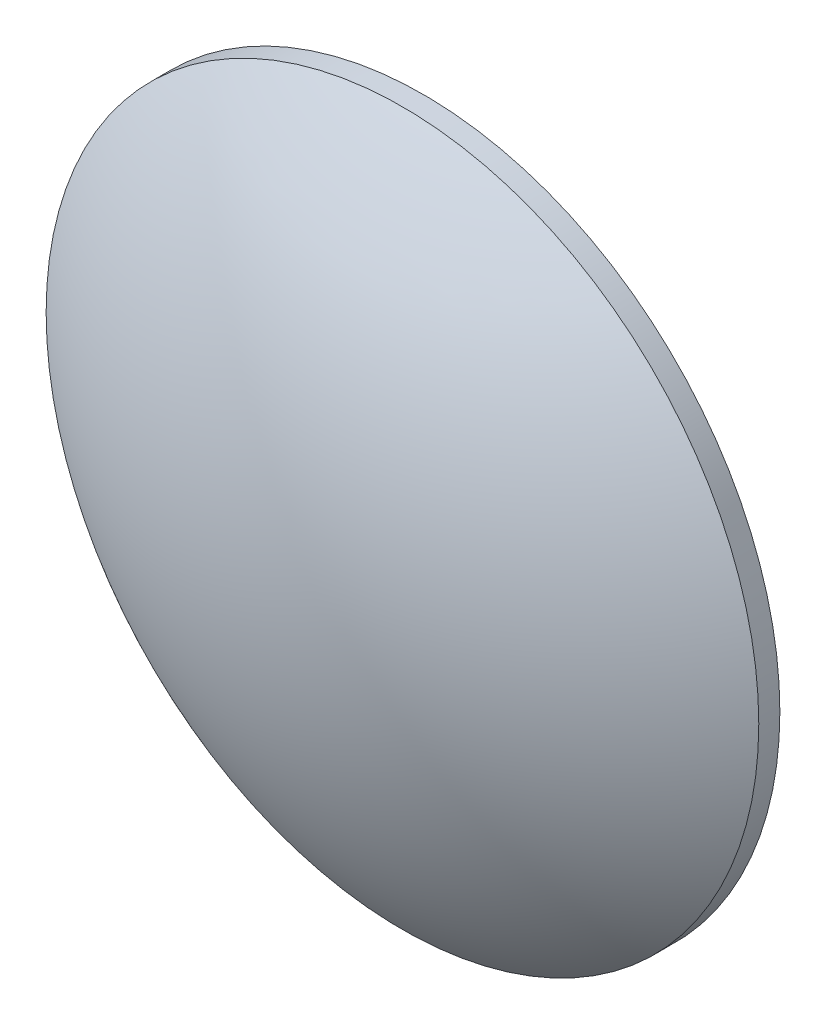
ISO-10303-21;
HEADER;
FILE_DESCRIPTION(('STEP AP214'),'2;1');
FILE_NAME('part.step','',(''),(''),'','','');
FILE_SCHEMA(('AUTOMOTIVE_DESIGN { 1 0 10303 214 1 1 1 1 }'));
ENDSEC;
DATA;
#1=APPLICATION_CONTEXT('core data for automotive mechanical design processes');
#2=APPLICATION_PROTOCOL_DEFINITION('international standard','automotive_design',2000,#1);
#3=PRODUCT_CONTEXT('',#1,'mechanical');
#4=PRODUCT('Part','Part','',(#3));
#5=PRODUCT_RELATED_PRODUCT_CATEGORY('part','',(#4));
#6=PRODUCT_DEFINITION_FORMATION('','',#4);
#7=PRODUCT_DEFINITION_CONTEXT('part definition',#1,'design');
#8=PRODUCT_DEFINITION('design','',#6,#7);
#9=PRODUCT_DEFINITION_SHAPE('','',#8);
#10=(LENGTH_UNIT() NAMED_UNIT(*) SI_UNIT(.MILLI.,.METRE.));
#11=(NAMED_UNIT(*) PLANE_ANGLE_UNIT() SI_UNIT($,.RADIAN.));
#12=(NAMED_UNIT(*) SI_UNIT($,.STERADIAN.) SOLID_ANGLE_UNIT());
#13=UNCERTAINTY_MEASURE_WITH_UNIT(LENGTH_MEASURE(1.E-05),#10,'distance_accuracy_value','');
#14=(GEOMETRIC_REPRESENTATION_CONTEXT(3) GLOBAL_UNCERTAINTY_ASSIGNED_CONTEXT((#13)) GLOBAL_UNIT_ASSIGNED_CONTEXT((#10,
#11,#12)) REPRESENTATION_CONTEXT('',''));
#15=CARTESIAN_POINT('',(0.,0.,0.));
#16=DIRECTION('',(0.,0.,1.));
#17=DIRECTION('',(1.,0.,0.));
#18=AXIS2_PLACEMENT_3D('',#15,#16,#17);
#19=CARTESIAN_POINT('',(0.,0.,0.));
#20=DIRECTION('',(0.,1.,0.));
#21=DIRECTION('',(1.,0.,0.));
#22=AXIS2_PLACEMENT_3D('',#19,#20,#21);
#23=SPHERICAL_SURFACE('',#22,42.738);
#24=CARTESIAN_POINT('',(0.,0.,0.));
#25=DIRECTION('',(0.,0.,-1.));
#26=DIRECTION('',(-1.,0.,0.));
#27=AXIS2_PLACEMENT_3D('',#24,#25,#26);
#28=SPHERICAL_SURFACE('',#27,42.738);
#29=CARTESIAN_POINT('',(0.,0.,34.3711600618891));
#30=DIRECTION('',(0.,0.,-1.));
#31=DIRECTION('',(-1.,0.,0.));
#32=AXIS2_PLACEMENT_3D('',#29,#30,#31);
#33=CIRCLE('',#32,25.4);
#34=CARTESIAN_POINT('',(-25.4,0.,34.3711600618891));
#35=VERTEX_POINT('',#34);
#36=EDGE_CURVE('E11',#35,#35,#33,.F.);
#37=ORIENTED_EDGE('',*,*,#36,.T.);
#38=EDGE_LOOP('',(#37));
#39=FACE_BOUND('',#38,.T.);
#40=ADVANCED_FACE('F36',(#39),#28,.T.);
#41=CARTESIAN_POINT('',(0.,0.,-42.738));
#42=DIRECTION('',(0.,0.,1.));
#43=DIRECTION('',(1.,0.,0.));
#44=AXIS2_PLACEMENT_3D('',#41,#42,#43);
#45=CYLINDRICAL_SURFACE('',#44,25.4);
#46=CARTESIAN_POINT('',(0.,0.,32.868));
#47=DIRECTION('',(0.,0.,1.));
#48=DIRECTION('',(1.,0.,0.));
#49=AXIS2_PLACEMENT_3D('',#46,#47,#48);
#50=CIRCLE('',#49,25.4);
#51=CARTESIAN_POINT('',(25.4,0.,32.868));
#52=VERTEX_POINT('',#51);
#53=EDGE_CURVE('E42',#52,#52,#50,.T.);
#54=ORIENTED_EDGE('',*,*,#53,.T.);
#55=EDGE_LOOP('',(#54));
#56=FACE_BOUND('',#55,.T.);
#57=ORIENTED_EDGE('',*,*,#36,.F.);
#58=EDGE_LOOP('',(#57));
#59=FACE_BOUND('',#58,.T.);
#60=ADVANCED_FACE('F48',(#56,#59),#45,.T.);
#61=CARTESIAN_POINT('',(0.,0.,32.868));
#62=DIRECTION('',(0.,0.,1.));
#63=DIRECTION('',(1.,0.,0.));
#64=AXIS2_PLACEMENT_3D('',#61,#62,#63);
#65=PLANE('',#64);
#66=ORIENTED_EDGE('',*,*,#53,.F.);
#67=EDGE_LOOP('',(#66));
#68=FACE_BOUND('',#67,.T.);
#69=ADVANCED_FACE('F51',(#68),#65,.F.);
#70=CLOSED_SHELL('',(#40,#60,#69));
#71=MANIFOLD_SOLID_BREP('B2',#70);
#72=ADVANCED_BREP_SHAPE_REPRESENTATION('',(#18,#71),#14);
#73=SHAPE_DEFINITION_REPRESENTATION(#9,#72);
ENDSEC;
END-ISO-10303-21;
